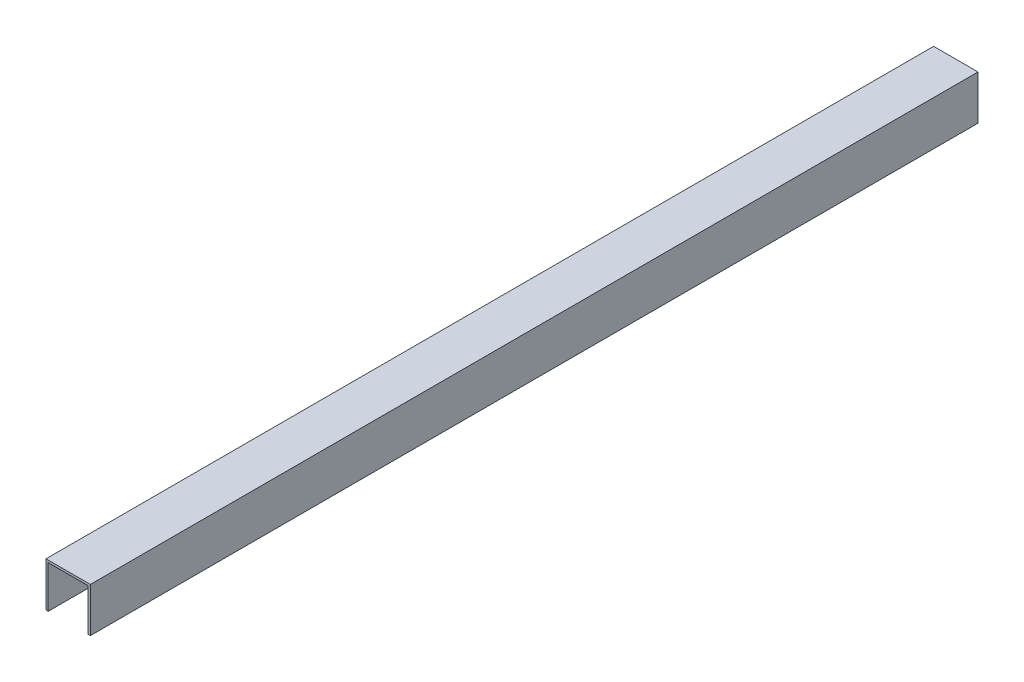
ISO-10303-21;
HEADER;
FILE_DESCRIPTION(('STEP AP214'),'2;1');
FILE_NAME('part.step','',(''),(''),'','','');
FILE_SCHEMA(('AUTOMOTIVE_DESIGN { 1 0 10303 214 1 1 1 1 }'));
ENDSEC;
DATA;
#1=APPLICATION_CONTEXT('core data for automotive mechanical design processes');
#2=APPLICATION_PROTOCOL_DEFINITION('international standard','automotive_design',2000,#1);
#3=PRODUCT_CONTEXT('',#1,'mechanical');
#4=PRODUCT('Part','Part','',(#3));
#5=PRODUCT_RELATED_PRODUCT_CATEGORY('part','',(#4));
#6=PRODUCT_DEFINITION_FORMATION('','',#4);
#7=PRODUCT_DEFINITION_CONTEXT('part definition',#1,'design');
#8=PRODUCT_DEFINITION('design','',#6,#7);
#9=PRODUCT_DEFINITION_SHAPE('','',#8);
#10=(LENGTH_UNIT() NAMED_UNIT(*) SI_UNIT(.MILLI.,.METRE.));
#11=(NAMED_UNIT(*) PLANE_ANGLE_UNIT() SI_UNIT($,.RADIAN.));
#12=(NAMED_UNIT(*) SI_UNIT($,.STERADIAN.) SOLID_ANGLE_UNIT());
#13=UNCERTAINTY_MEASURE_WITH_UNIT(LENGTH_MEASURE(1.E-05),#10,'distance_accuracy_value','');
#14=(GEOMETRIC_REPRESENTATION_CONTEXT(3) GLOBAL_UNCERTAINTY_ASSIGNED_CONTEXT((#13)) GLOBAL_UNIT_ASSIGNED_CONTEXT((#10,
#11,#12)) REPRESENTATION_CONTEXT('',''));
#15=CARTESIAN_POINT('',(0.,0.,0.));
#16=DIRECTION('',(0.,0.,1.));
#17=DIRECTION('',(1.,0.,0.));
#18=AXIS2_PLACEMENT_3D('',#15,#16,#17);
#19=CARTESIAN_POINT('',(-106.941493858928,-9.23320510783608,200.));
#20=DIRECTION('',(0.,1.,0.));
#21=DIRECTION('',(-1.,0.,0.));
#22=AXIS2_PLACEMENT_3D('',#19,#20,#21);
#23=PLANE('',#22);
#24=DIRECTION('',(1.,0.,0.));
#25=VECTOR('',#24,1.);
#26=CARTESIAN_POINT('',(-106.941493858928,-9.23320510783608,0.));
#27=LINE('',#26,#25);
#28=CARTESIAN_POINT('',(-107.441493858928,-9.23320510783608,0.));
#29=VERTEX_POINT('',#28);
#30=CARTESIAN_POINT('',(-106.941493858928,-9.23320510783608,0.));
#31=VERTEX_POINT('',#30);
#32=EDGE_CURVE('E129',#29,#31,#27,.T.);
#33=ORIENTED_EDGE('',*,*,#32,.T.);
#34=DIRECTION('',(0.,0.,-1.));
#35=VECTOR('',#34,1.);
#36=CARTESIAN_POINT('',(-106.941493858928,-9.23320510783608,200.));
#37=LINE('',#36,#35);
#38=CARTESIAN_POINT('',(-106.941493858928,-9.23320510783608,200.));
#39=VERTEX_POINT('',#38);
#40=EDGE_CURVE('E11',#39,#31,#37,.T.);
#41=ORIENTED_EDGE('',*,*,#40,.F.);
#42=DIRECTION('',(1.,0.,0.));
#43=VECTOR('',#42,1.);
#44=CARTESIAN_POINT('',(-106.941493858928,-9.23320510783608,200.));
#45=LINE('',#44,#43);
#46=CARTESIAN_POINT('',(-107.441493858928,-9.23320510783608,200.));
#47=VERTEX_POINT('',#46);
#48=EDGE_CURVE('E143',#47,#39,#45,.T.);
#49=ORIENTED_EDGE('',*,*,#48,.F.);
#50=DIRECTION('',(0.,0.,-1.));
#51=VECTOR('',#50,1.);
#52=CARTESIAN_POINT('',(-107.441493858928,-9.23320510783608,200.));
#53=LINE('',#52,#51);
#54=EDGE_CURVE('E125',#47,#29,#53,.T.);
#55=ORIENTED_EDGE('',*,*,#54,.T.);
#56=EDGE_LOOP('',(#33,#41,#49,#55));
#57=FACE_BOUND('',#56,.T.);
#58=ADVANCED_FACE('F33',(#57),#23,.F.);
#59=CARTESIAN_POINT('',(-106.941493858928,0.266794892163913,200.));
#60=DIRECTION('',(-1.,0.,0.));
#61=DIRECTION('',(0.,0.,1.));
#62=AXIS2_PLACEMENT_3D('',#59,#60,#61);
#63=PLANE('',#62);
#64=DIRECTION('',(0.,1.,0.));
#65=VECTOR('',#64,1.);
#66=CARTESIAN_POINT('',(-106.941493858928,0.266794892163913,0.));
#67=LINE('',#66,#65);
#68=CARTESIAN_POINT('',(-106.941493858928,0.266794892163913,0.));
#69=VERTEX_POINT('',#68);
#70=EDGE_CURVE('E132',#31,#69,#67,.T.);
#71=ORIENTED_EDGE('',*,*,#70,.T.);
#72=DIRECTION('',(0.,0.,-1.));
#73=VECTOR('',#72,1.);
#74=CARTESIAN_POINT('',(-106.941493858928,0.266794892163913,200.));
#75=LINE('',#74,#73);
#76=CARTESIAN_POINT('',(-106.941493858928,0.266794892163913,200.));
#77=VERTEX_POINT('',#76);
#78=EDGE_CURVE('E41',#77,#69,#75,.T.);
#79=ORIENTED_EDGE('',*,*,#78,.F.);
#80=DIRECTION('',(0.,1.,0.));
#81=VECTOR('',#80,1.);
#82=CARTESIAN_POINT('',(-106.941493858928,0.266794892163913,200.));
#83=LINE('',#82,#81);
#84=EDGE_CURVE('E92',#39,#77,#83,.T.);
#85=ORIENTED_EDGE('',*,*,#84,.F.);
#86=ORIENTED_EDGE('',*,*,#40,.T.);
#87=EDGE_LOOP('',(#71,#79,#85,#86));
#88=FACE_BOUND('',#87,.T.);
#89=ADVANCED_FACE('F178',(#88),#63,.F.);
#90=CARTESIAN_POINT('',(-97.9414938589285,0.266794892163915,200.));
#91=DIRECTION('',(0.,1.,0.));
#92=DIRECTION('',(-1.,0.,0.));
#93=AXIS2_PLACEMENT_3D('',#90,#91,#92);
#94=PLANE('',#93);
#95=DIRECTION('',(1.,0.,0.));
#96=VECTOR('',#95,1.);
#97=CARTESIAN_POINT('',(-97.9414938589285,0.266794892163915,0.));
#98=LINE('',#97,#96);
#99=CARTESIAN_POINT('',(-97.9414938589285,0.266794892163915,0.));
#100=VERTEX_POINT('',#99);
#101=EDGE_CURVE('E134',#69,#100,#98,.T.);
#102=ORIENTED_EDGE('',*,*,#101,.T.);
#103=DIRECTION('',(0.,0.,-1.));
#104=VECTOR('',#103,1.);
#105=CARTESIAN_POINT('',(-97.9414938589285,0.266794892163915,200.));
#106=LINE('',#105,#104);
#107=CARTESIAN_POINT('',(-97.9414938589285,0.266794892163915,200.));
#108=VERTEX_POINT('',#107);
#109=EDGE_CURVE('E150',#108,#100,#106,.T.);
#110=ORIENTED_EDGE('',*,*,#109,.F.);
#111=DIRECTION('',(1.,0.,0.));
#112=VECTOR('',#111,1.);
#113=CARTESIAN_POINT('',(-97.9414938589285,0.266794892163915,200.));
#114=LINE('',#113,#112);
#115=EDGE_CURVE('E158',#77,#108,#114,.T.);
#116=ORIENTED_EDGE('',*,*,#115,.F.);
#117=ORIENTED_EDGE('',*,*,#78,.T.);
#118=EDGE_LOOP('',(#102,#110,#116,#117));
#119=FACE_BOUND('',#118,.T.);
#120=ADVANCED_FACE('F156',(#119),#94,.F.);
#121=CARTESIAN_POINT('',(-97.9414938589285,-9.23320510783608,200.));
#122=DIRECTION('',(1.,0.,0.));
#123=DIRECTION('',(0.,0.,-1.));
#124=AXIS2_PLACEMENT_3D('',#121,#122,#123);
#125=PLANE('',#124);
#126=DIRECTION('',(0.,-1.,0.));
#127=VECTOR('',#126,1.);
#128=CARTESIAN_POINT('',(-97.9414938589285,-9.23320510783608,0.));
#129=LINE('',#128,#127);
#130=CARTESIAN_POINT('',(-97.9414938589285,-9.23320510783608,0.));
#131=VERTEX_POINT('',#130);
#132=EDGE_CURVE('E136',#100,#131,#129,.T.);
#133=ORIENTED_EDGE('',*,*,#132,.T.);
#134=DIRECTION('',(0.,0.,-1.));
#135=VECTOR('',#134,1.);
#136=CARTESIAN_POINT('',(-97.9414938589285,-9.23320510783608,200.));
#137=LINE('',#136,#135);
#138=CARTESIAN_POINT('',(-97.9414938589285,-9.23320510783608,200.));
#139=VERTEX_POINT('',#138);
#140=EDGE_CURVE('E147',#139,#131,#137,.T.);
#141=ORIENTED_EDGE('',*,*,#140,.F.);
#142=DIRECTION('',(0.,-1.,0.));
#143=VECTOR('',#142,1.);
#144=CARTESIAN_POINT('',(-97.9414938589285,-9.23320510783608,200.));
#145=LINE('',#144,#143);
#146=EDGE_CURVE('E170',#108,#139,#145,.T.);
#147=ORIENTED_EDGE('',*,*,#146,.F.);
#148=ORIENTED_EDGE('',*,*,#109,.T.);
#149=EDGE_LOOP('',(#133,#141,#147,#148));
#150=FACE_BOUND('',#149,.T.);
#151=ADVANCED_FACE('F166',(#150),#125,.F.);
#152=CARTESIAN_POINT('',(-97.4414938589285,-9.23320510783608,200.));
#153=DIRECTION('',(0.,1.,0.));
#154=DIRECTION('',(-1.,0.,0.));
#155=AXIS2_PLACEMENT_3D('',#152,#153,#154);
#156=PLANE('',#155);
#157=DIRECTION('',(1.,0.,0.));
#158=VECTOR('',#157,1.);
#159=CARTESIAN_POINT('',(-97.4414938589285,-9.23320510783608,0.));
#160=LINE('',#159,#158);
#161=CARTESIAN_POINT('',(-97.4414938589285,-9.23320510783608,0.));
#162=VERTEX_POINT('',#161);
#163=EDGE_CURVE('E138',#131,#162,#160,.T.);
#164=ORIENTED_EDGE('',*,*,#163,.T.);
#165=DIRECTION('',(0.,0.,-1.));
#166=VECTOR('',#165,1.);
#167=CARTESIAN_POINT('',(-97.4414938589285,-9.23320510783608,200.));
#168=LINE('',#167,#166);
#169=CARTESIAN_POINT('',(-97.4414938589285,-9.23320510783608,200.));
#170=VERTEX_POINT('',#169);
#171=EDGE_CURVE('E120',#170,#162,#168,.T.);
#172=ORIENTED_EDGE('',*,*,#171,.F.);
#173=DIRECTION('',(1.,0.,0.));
#174=VECTOR('',#173,1.);
#175=CARTESIAN_POINT('',(-97.4414938589285,-9.23320510783608,200.));
#176=LINE('',#175,#174);
#177=EDGE_CURVE('E111',#139,#170,#176,.T.);
#178=ORIENTED_EDGE('',*,*,#177,.F.);
#179=ORIENTED_EDGE('',*,*,#140,.T.);
#180=EDGE_LOOP('',(#164,#172,#178,#179));
#181=FACE_BOUND('',#180,.T.);
#182=ADVANCED_FACE('F169',(#181),#156,.F.);
#183=CARTESIAN_POINT('',(-97.4414938589285,0.766794892163917,200.));
#184=DIRECTION('',(-1.,0.,0.));
#185=DIRECTION('',(0.,0.,1.));
#186=AXIS2_PLACEMENT_3D('',#183,#184,#185);
#187=PLANE('',#186);
#188=DIRECTION('',(0.,1.,0.));
#189=VECTOR('',#188,1.);
#190=CARTESIAN_POINT('',(-97.4414938589285,0.766794892163917,0.));
#191=LINE('',#190,#189);
#192=CARTESIAN_POINT('',(-97.4414938589285,0.766794892163917,0.));
#193=VERTEX_POINT('',#192);
#194=EDGE_CURVE('E119',#162,#193,#191,.T.);
#195=ORIENTED_EDGE('',*,*,#194,.T.);
#196=DIRECTION('',(0.,0.,-1.));
#197=VECTOR('',#196,1.);
#198=CARTESIAN_POINT('',(-97.4414938589285,0.766794892163917,200.));
#199=LINE('',#198,#197);
#200=CARTESIAN_POINT('',(-97.4414938589285,0.766794892163917,200.));
#201=VERTEX_POINT('',#200);
#202=EDGE_CURVE('E116',#201,#193,#199,.T.);
#203=ORIENTED_EDGE('',*,*,#202,.F.);
#204=DIRECTION('',(0.,1.,0.));
#205=VECTOR('',#204,1.);
#206=CARTESIAN_POINT('',(-97.4414938589285,0.766794892163917,200.));
#207=LINE('',#206,#205);
#208=EDGE_CURVE('E105',#170,#201,#207,.T.);
#209=ORIENTED_EDGE('',*,*,#208,.F.);
#210=ORIENTED_EDGE('',*,*,#171,.T.);
#211=EDGE_LOOP('',(#195,#203,#209,#210));
#212=FACE_BOUND('',#211,.T.);
#213=ADVANCED_FACE('F117',(#212),#187,.F.);
#214=CARTESIAN_POINT('',(-107.441493858928,0.766794892163913,200.));
#215=DIRECTION('',(0.,-1.,0.));
#216=DIRECTION('',(1.,0.,0.));
#217=AXIS2_PLACEMENT_3D('',#214,#215,#216);
#218=PLANE('',#217);
#219=DIRECTION('',(-1.,0.,0.));
#220=VECTOR('',#219,1.);
#221=CARTESIAN_POINT('',(-107.441493858928,0.766794892163913,0.));
#222=LINE('',#221,#220);
#223=CARTESIAN_POINT('',(-107.441493858928,0.766794892163913,0.));
#224=VERTEX_POINT('',#223);
#225=EDGE_CURVE('E78',#193,#224,#222,.T.);
#226=ORIENTED_EDGE('',*,*,#225,.T.);
#227=DIRECTION('',(0.,0.,-1.));
#228=VECTOR('',#227,1.);
#229=CARTESIAN_POINT('',(-107.441493858928,0.766794892163913,200.));
#230=LINE('',#229,#228);
#231=CARTESIAN_POINT('',(-107.441493858928,0.766794892163913,200.));
#232=VERTEX_POINT('',#231);
#233=EDGE_CURVE('E121',#232,#224,#230,.T.);
#234=ORIENTED_EDGE('',*,*,#233,.F.);
#235=DIRECTION('',(-1.,0.,0.));
#236=VECTOR('',#235,1.);
#237=CARTESIAN_POINT('',(-107.441493858928,0.766794892163913,200.));
#238=LINE('',#237,#236);
#239=EDGE_CURVE('E109',#201,#232,#238,.T.);
#240=ORIENTED_EDGE('',*,*,#239,.F.);
#241=ORIENTED_EDGE('',*,*,#202,.T.);
#242=EDGE_LOOP('',(#226,#234,#240,#241));
#243=FACE_BOUND('',#242,.T.);
#244=ADVANCED_FACE('F123',(#243),#218,.F.);
#245=CARTESIAN_POINT('',(-107.441493858928,-9.23320510783608,200.));
#246=DIRECTION('',(1.,0.,0.));
#247=DIRECTION('',(0.,0.,-1.));
#248=AXIS2_PLACEMENT_3D('',#245,#246,#247);
#249=PLANE('',#248);
#250=DIRECTION('',(0.,-1.,0.));
#251=VECTOR('',#250,1.);
#252=CARTESIAN_POINT('',(-107.441493858928,-9.23320510783608,0.));
#253=LINE('',#252,#251);
#254=EDGE_CURVE('E84',#224,#29,#253,.T.);
#255=ORIENTED_EDGE('',*,*,#254,.T.);
#256=ORIENTED_EDGE('',*,*,#54,.F.);
#257=DIRECTION('',(0.,-1.,0.));
#258=VECTOR('',#257,1.);
#259=CARTESIAN_POINT('',(-107.441493858928,-9.23320510783608,200.));
#260=LINE('',#259,#258);
#261=EDGE_CURVE('E49',#232,#47,#260,.T.);
#262=ORIENTED_EDGE('',*,*,#261,.F.);
#263=ORIENTED_EDGE('',*,*,#233,.T.);
#264=EDGE_LOOP('',(#255,#256,#262,#263));
#265=FACE_BOUND('',#264,.T.);
#266=ADVANCED_FACE('F194',(#265),#249,.F.);
#267=CARTESIAN_POINT('',(0.,0.,200.));
#268=DIRECTION('',(0.,0.,-1.));
#269=DIRECTION('',(-1.,0.,0.));
#270=AXIS2_PLACEMENT_3D('',#267,#268,#269);
#271=PLANE('',#270);
#272=ORIENTED_EDGE('',*,*,#48,.T.);
#273=ORIENTED_EDGE('',*,*,#84,.T.);
#274=ORIENTED_EDGE('',*,*,#115,.T.);
#275=ORIENTED_EDGE('',*,*,#146,.T.);
#276=ORIENTED_EDGE('',*,*,#177,.T.);
#277=ORIENTED_EDGE('',*,*,#208,.T.);
#278=ORIENTED_EDGE('',*,*,#239,.T.);
#279=ORIENTED_EDGE('',*,*,#261,.T.);
#280=EDGE_LOOP('',(#272,#273,#274,#275,#276,#277,#278,#279));
#281=FACE_BOUND('',#280,.T.);
#282=ADVANCED_FACE('F107',(#281),#271,.F.);
#283=CARTESIAN_POINT('',(0.,0.,0.));
#284=DIRECTION('',(0.,0.,-1.));
#285=DIRECTION('',(-1.,0.,0.));
#286=AXIS2_PLACEMENT_3D('',#283,#284,#285);
#287=PLANE('',#286);
#288=ORIENTED_EDGE('',*,*,#32,.F.);
#289=ORIENTED_EDGE('',*,*,#254,.F.);
#290=ORIENTED_EDGE('',*,*,#225,.F.);
#291=ORIENTED_EDGE('',*,*,#194,.F.);
#292=ORIENTED_EDGE('',*,*,#163,.F.);
#293=ORIENTED_EDGE('',*,*,#132,.F.);
#294=ORIENTED_EDGE('',*,*,#101,.F.);
#295=ORIENTED_EDGE('',*,*,#70,.F.);
#296=EDGE_LOOP('',(#288,#289,#290,#291,#292,#293,#294,#295));
#297=FACE_BOUND('',#296,.T.);
#298=ADVANCED_FACE('F162',(#297),#287,.T.);
#299=CLOSED_SHELL('',(#58,#89,#120,#151,#182,#213,#244,#266,#282,#298));
#300=MANIFOLD_SOLID_BREP('B2',#299);
#301=ADVANCED_BREP_SHAPE_REPRESENTATION('',(#18,#300),#14);
#302=SHAPE_DEFINITION_REPRESENTATION(#9,#301);
ENDSEC;
END-ISO-10303-21;
